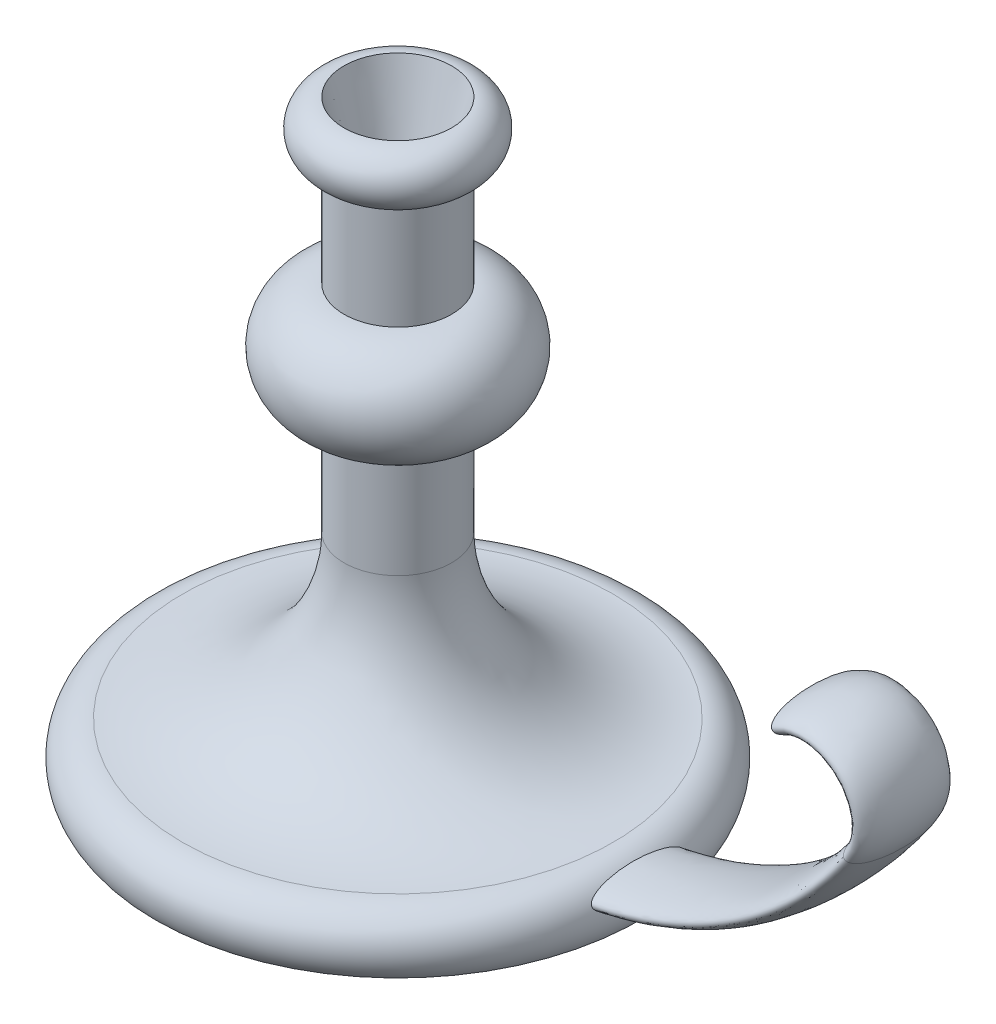
ISO-10303-21;
HEADER;
FILE_DESCRIPTION(('STEP AP214'),'2;1');
FILE_NAME('part.step','',(''),(''),'','','');
FILE_SCHEMA(('AUTOMOTIVE_DESIGN { 1 0 10303 214 1 1 1 1 }'));
ENDSEC;
DATA;
#1=APPLICATION_CONTEXT('core data for automotive mechanical design processes');
#2=APPLICATION_PROTOCOL_DEFINITION('international standard','automotive_design',2000,#1);
#3=PRODUCT_CONTEXT('',#1,'mechanical');
#4=PRODUCT('Part','Part','',(#3));
#5=PRODUCT_RELATED_PRODUCT_CATEGORY('part','',(#4));
#6=PRODUCT_DEFINITION_FORMATION('','',#4);
#7=PRODUCT_DEFINITION_CONTEXT('part definition',#1,'design');
#8=PRODUCT_DEFINITION('design','',#6,#7);
#9=PRODUCT_DEFINITION_SHAPE('','',#8);
#10=(LENGTH_UNIT() NAMED_UNIT(*) SI_UNIT(.MILLI.,.METRE.));
#11=(NAMED_UNIT(*) PLANE_ANGLE_UNIT() SI_UNIT($,.RADIAN.));
#12=(NAMED_UNIT(*) SI_UNIT($,.STERADIAN.) SOLID_ANGLE_UNIT());
#13=UNCERTAINTY_MEASURE_WITH_UNIT(LENGTH_MEASURE(1.E-05),#10,'distance_accuracy_value','');
#14=(GEOMETRIC_REPRESENTATION_CONTEXT(3) GLOBAL_UNCERTAINTY_ASSIGNED_CONTEXT((#13)) GLOBAL_UNIT_ASSIGNED_CONTEXT((#10,
#11,#12)) REPRESENTATION_CONTEXT('',''));
#15=CARTESIAN_POINT('',(0.,0.,0.));
#16=DIRECTION('',(0.,0.,1.));
#17=DIRECTION('',(1.,0.,0.));
#18=AXIS2_PLACEMENT_3D('',#15,#16,#17);
#19=CARTESIAN_POINT('',(0.,0.,0.));
#20=DIRECTION('',(0.,-1.,0.));
#21=DIRECTION('',(0.,0.,-1.));
#22=AXIS2_PLACEMENT_3D('',#19,#20,#21);
#23=PLANE('',#22);
#24=CARTESIAN_POINT('',(0.,0.,0.));
#25=DIRECTION('',(0.,-1.,0.));
#26=DIRECTION('',(0.,0.,-1.));
#27=AXIS2_PLACEMENT_3D('',#24,#25,#26);
#28=CIRCLE('',#27,90.);
#29=CARTESIAN_POINT('',(0.,0.,-90.));
#30=VERTEX_POINT('',#29);
#31=EDGE_CURVE('E77',#30,#30,#28,.T.);
#32=ORIENTED_EDGE('',*,*,#31,.T.);
#33=EDGE_LOOP('',(#32));
#34=FACE_BOUND('',#33,.T.);
#35=ADVANCED_FACE('F41',(#34),#23,.T.);
#36=CARTESIAN_POINT('',(0.,210.,0.));
#37=DIRECTION('',(0.,-1.,0.));
#38=DIRECTION('',(0.,0.,-1.));
#39=AXIS2_PLACEMENT_3D('',#36,#37,#38);
#40=TOROIDAL_SURFACE('',#39,20.,9.99999999999999);
#41=CARTESIAN_POINT('',(0.,220.,0.));
#42=DIRECTION('',(0.,1.,0.));
#43=DIRECTION('',(0.,0.,1.));
#44=AXIS2_PLACEMENT_3D('',#41,#42,#43);
#45=CIRCLE('',#44,20.);
#46=CARTESIAN_POINT('',(0.,220.,20.));
#47=VERTEX_POINT('',#46);
#48=EDGE_CURVE('E93',#47,#47,#45,.T.);
#49=ORIENTED_EDGE('',*,*,#48,.F.);
#50=EDGE_LOOP('',(#49));
#51=FACE_BOUND('',#50,.T.);
#52=CARTESIAN_POINT('',(0.,200.,0.));
#53=DIRECTION('',(0.,-1.,0.));
#54=DIRECTION('',(0.,0.,-1.));
#55=AXIS2_PLACEMENT_3D('',#52,#53,#54);
#56=CIRCLE('',#55,20.);
#57=CARTESIAN_POINT('',(0.,200.,-20.));
#58=VERTEX_POINT('',#57);
#59=EDGE_CURVE('E53',#58,#58,#56,.T.);
#60=ORIENTED_EDGE('',*,*,#59,.F.);
#61=EDGE_LOOP('',(#60));
#62=FACE_BOUND('',#61,.T.);
#63=ADVANCED_FACE('F100',(#51,#62),#40,.T.);
#64=CARTESIAN_POINT('',(0.,0.,0.));
#65=DIRECTION('',(0.,-1.,0.));
#66=DIRECTION('',(0.,0.,-1.));
#67=AXIS2_PLACEMENT_3D('',#64,#65,#66);
#68=CYLINDRICAL_SURFACE('',#67,20.);
#69=ORIENTED_EDGE('',*,*,#59,.T.);
#70=EDGE_LOOP('',(#69));
#71=FACE_BOUND('',#70,.T.);
#72=CARTESIAN_POINT('',(0.,160.,0.));
#73=DIRECTION('',(0.,-1.,0.));
#74=DIRECTION('',(0.,0.,-1.));
#75=AXIS2_PLACEMENT_3D('',#72,#73,#74);
#76=CIRCLE('',#75,20.);
#77=CARTESIAN_POINT('',(0.,160.,-20.));
#78=VERTEX_POINT('',#77);
#79=EDGE_CURVE('E58',#78,#78,#76,.T.);
#80=ORIENTED_EDGE('',*,*,#79,.F.);
#81=EDGE_LOOP('',(#80));
#82=FACE_BOUND('',#81,.T.);
#83=ADVANCED_FACE('F103',(#71,#82),#68,.T.);
#84=CARTESIAN_POINT('',(0.,140.,0.));
#85=DIRECTION('',(0.,-1.,0.));
#86=DIRECTION('',(0.,0.,-1.));
#87=AXIS2_PLACEMENT_3D('',#84,#85,#86);
#88=TOROIDAL_SURFACE('',#87,20.,20.);
#89=ORIENTED_EDGE('',*,*,#79,.T.);
#90=EDGE_LOOP('',(#89));
#91=FACE_BOUND('',#90,.T.);
#92=CARTESIAN_POINT('',(0.,120.,0.));
#93=DIRECTION('',(0.,-1.,0.));
#94=DIRECTION('',(0.,0.,-1.));
#95=AXIS2_PLACEMENT_3D('',#92,#93,#94);
#96=CIRCLE('',#95,20.);
#97=CARTESIAN_POINT('',(0.,120.,-20.));
#98=VERTEX_POINT('',#97);
#99=EDGE_CURVE('E63',#98,#98,#96,.T.);
#100=ORIENTED_EDGE('',*,*,#99,.F.);
#101=EDGE_LOOP('',(#100));
#102=FACE_BOUND('',#101,.T.);
#103=ADVANCED_FACE('F108',(#91,#102),#88,.T.);
#104=CARTESIAN_POINT('',(0.,0.,0.));
#105=DIRECTION('',(0.,-1.,0.));
#106=DIRECTION('',(0.,0.,-1.));
#107=AXIS2_PLACEMENT_3D('',#104,#105,#106);
#108=CYLINDRICAL_SURFACE('',#107,20.);
#109=ORIENTED_EDGE('',*,*,#99,.T.);
#110=EDGE_LOOP('',(#109));
#111=FACE_BOUND('',#110,.T.);
#112=CARTESIAN_POINT('',(0.,80.,0.));
#113=DIRECTION('',(0.,-1.,0.));
#114=DIRECTION('',(0.,0.,-1.));
#115=AXIS2_PLACEMENT_3D('',#112,#113,#114);
#116=CIRCLE('',#115,20.);
#117=CARTESIAN_POINT('',(0.,80.,-20.));
#118=VERTEX_POINT('',#117);
#119=EDGE_CURVE('E69',#118,#118,#116,.T.);
#120=ORIENTED_EDGE('',*,*,#119,.F.);
#121=EDGE_LOOP('',(#120));
#122=FACE_BOUND('',#121,.T.);
#123=ADVANCED_FACE('F114',(#111,#122),#108,.T.);
#124=CARTESIAN_POINT('',(0.,80.,0.));
#125=DIRECTION('',(0.,-1.,0.));
#126=DIRECTION('',(0.,0.,-1.));
#127=AXIS2_PLACEMENT_3D('',#124,#125,#126);
#128=TOROIDAL_SURFACE('',#127,80.,60.);
#129=ORIENTED_EDGE('',*,*,#119,.T.);
#130=EDGE_LOOP('',(#129));
#131=FACE_BOUND('',#130,.T.);
#132=CARTESIAN_POINT('',(0.,20.,0.));
#133=DIRECTION('',(0.,-1.,0.));
#134=DIRECTION('',(0.,0.,-1.));
#135=AXIS2_PLACEMENT_3D('',#132,#133,#134);
#136=CIRCLE('',#135,80.);
#137=CARTESIAN_POINT('',(0.,20.,-80.));
#138=VERTEX_POINT('',#137);
#139=EDGE_CURVE('E73',#138,#138,#136,.T.);
#140=ORIENTED_EDGE('',*,*,#139,.F.);
#141=EDGE_LOOP('',(#140));
#142=FACE_BOUND('',#141,.T.);
#143=ADVANCED_FACE('F118',(#131,#142),#128,.F.);
#144=CARTESIAN_POINT('',(0.,7.50000000000003,0.));
#145=DIRECTION('',(0.,-1.,0.));
#146=DIRECTION('',(0.,0.,-1.));
#147=AXIS2_PLACEMENT_3D('',#144,#145,#146);
#148=TOROIDAL_SURFACE('',#147,80.,12.5);
#149=CARTESIAN_POINT('',(89.5597422043342,12.9414346567555,-17.5));
#150=CARTESIAN_POINT('',(89.5390618403562,12.9834100865229,-17.4999996776707));
#151=CARTESIAN_POINT('',(89.518481763466,13.0254349004937,-17.4978446678338));
#152=CARTESIAN_POINT('',(89.4776811982744,13.1092324497794,-17.4892861575811));
#153=CARTESIAN_POINT('',(89.4574608430711,13.1510050881611,-17.4828811168849));
#154=CARTESIAN_POINT('',(89.397540281121,13.2754779151414,-17.4575154450276));
#155=CARTESIAN_POINT('',(89.3585808220613,13.357332519418,-17.4324042670614));
#156=CARTESIAN_POINT('',(89.2734407804368,13.5379179993389,-17.3597430943198));
#157=CARTESIAN_POINT('',(89.2281116968574,13.6353152430682,-17.3079906529225));
#158=CARTESIAN_POINT('',(89.142156713761,13.821757010941,-17.1881654215547));
#159=CARTESIAN_POINT('',(89.1015409681601,13.9107834263932,-17.1200583326704));
#160=CARTESIAN_POINT('',(89.0298799325306,14.0690063055582,-16.9825317839868));
#161=CARTESIAN_POINT('',(88.9982856031082,14.1392491335227,-16.9145677994464));
#162=CARTESIAN_POINT('',(88.9378435588022,14.2742914925202,-16.7722502997375));
#163=CARTESIAN_POINT('',(88.9089980734782,14.3390866000317,-16.6978916893925));
#164=CARTESIAN_POINT('',(88.8536099995594,14.4639626152392,-16.5442177801531));
#165=CARTESIAN_POINT('',(88.8270733532937,14.5240313225779,-16.4648905452803));
#166=CARTESIAN_POINT('',(88.7760376587064,14.6398576639347,-16.3025863942461));
#167=CARTESIAN_POINT('',(88.7515379613228,14.6956166708123,-16.219610653644));
#168=CARTESIAN_POINT('',(88.704732820549,14.8023169553036,-16.052427362784));
#169=CARTESIAN_POINT('',(88.6823939519366,14.8533308765833,-15.9682752160745));
#170=CARTESIAN_POINT('',(88.639155365759,14.9521540950118,-15.7977416210759));
#171=CARTESIAN_POINT('',(88.6182558899722,14.9999628537458,-15.711359801597));
#172=CARTESIAN_POINT('',(88.5573681790009,15.1392585624723,-15.4492483073625));
#173=CARTESIAN_POINT('',(88.5192579811328,15.2264609786255,-15.2707999543232));
#174=CARTESIAN_POINT('',(88.4468979005836,15.3916731276291,-14.9088289385944));
#175=CARTESIAN_POINT('',(88.4126513155027,15.4696750103546,-14.725302105289));
#176=CARTESIAN_POINT('',(88.347139159504,15.6182965032923,-14.3538259785736));
#177=CARTESIAN_POINT('',(88.3158872528146,15.6888824046966,-14.1658608782526));
#178=CARTESIAN_POINT('',(88.2560127035516,15.8233792512431,-13.7874003918539));
#179=CARTESIAN_POINT('',(88.2273872233003,15.8872974109117,-13.5969079973402));
#180=CARTESIAN_POINT('',(88.1723348827449,16.0094159388249,-13.213849673779));
#181=CARTESIAN_POINT('',(88.1459074726896,16.0676177374301,-13.021284276893));
#182=CARTESIAN_POINT('',(88.0884248304702,16.1932687928886,-12.5849658119247));
#183=CARTESIAN_POINT('',(88.0579162002184,16.2592725226906,-12.3407253521734));
#184=CARTESIAN_POINT('',(87.9994625659014,16.3844358500306,-11.8501803460781));
#185=CARTESIAN_POINT('',(87.9715178234089,16.4435947494062,-11.6038755919222));
#186=CARTESIAN_POINT('',(87.9178897421858,16.5558889779776,-11.1095299870479));
#187=CARTESIAN_POINT('',(87.8922075114269,16.6090213595568,-10.8614883492399));
#188=CARTESIAN_POINT('',(87.8429155378603,16.7098546386226,-10.3640943607017));
#189=CARTESIAN_POINT('',(87.8193058942812,16.7575552760879,-10.114741947821));
#190=CARTESIAN_POINT('',(87.7514718906047,16.8930622945828,-9.36631396644896));
#191=CARTESIAN_POINT('',(87.7101114199141,16.97354616682,-8.86564202060311));
#192=CARTESIAN_POINT('',(87.6344118706354,17.1178657179368,-7.86153551840225));
#193=CARTESIAN_POINT('',(87.600071334108,17.1817048544489,-7.35810155802561));
#194=CARTESIAN_POINT('',(87.5383679228555,17.2943697092708,-6.3522513611187));
#195=CARTESIAN_POINT('',(87.5109639050819,17.3432843238913,-5.84984753787553));
#196=CARTESIAN_POINT('',(87.4628391630612,17.4279603163538,-4.84354228831007));
#197=CARTESIAN_POINT('',(87.4421195253373,17.4637195559667,-4.33964063194087));
#198=CARTESIAN_POINT('',(87.4074386787955,17.5229738360405,-3.3308436388601));
#199=CARTESIAN_POINT('',(87.3934780874882,17.5464677559496,-2.82594821558678));
#200=CARTESIAN_POINT('',(87.3724154174236,17.5817273168609,-1.816152133808));
#201=CARTESIAN_POINT('',(87.365305974734,17.5935055508652,-1.31125206554517));
#202=CARTESIAN_POINT('',(87.3579750479625,17.6056484066489,-0.301318309132875));
#203=CARTESIAN_POINT('',(87.3577528582351,17.6060141977103,0.203715360026125));
#204=CARTESIAN_POINT('',(87.3641963426439,17.5953454261039,1.21356726554173));
#205=CARTESIAN_POINT('',(87.3708612610896,17.5843121142069,1.71838551945512));
#206=CARTESIAN_POINT('',(87.3886163883338,17.554616306541,2.60695068649856));
#207=CARTESIAN_POINT('',(87.3982690399213,17.5384060734754,2.99081046478843));
#208=CARTESIAN_POINT('',(87.421496688066,17.4990063104014,3.75807002785716));
#209=CARTESIAN_POINT('',(87.4350718235981,17.4758165331044,4.14146979585432));
#210=CARTESIAN_POINT('',(87.4661109016122,17.4221255760208,4.90767543763213));
#211=CARTESIAN_POINT('',(87.483575591365,17.3916229911934,5.29048118303763));
#212=CARTESIAN_POINT('',(87.52247652696,17.3226675403927,6.05728766608041));
#213=CARTESIAN_POINT('',(87.5439339089184,17.2841722314846,6.44128353835446));
#214=CARTESIAN_POINT('',(87.5907685418078,17.1987228636429,7.20803081067562));
#215=CARTESIAN_POINT('',(87.6161451191906,17.1517702579396,7.59078241304236));
#216=CARTESIAN_POINT('',(87.6708875244929,17.0486132676472,8.35453102594121));
#217=CARTESIAN_POINT('',(87.7002509792864,16.9924143825779,8.73552894189142));
#218=CARTESIAN_POINT('',(87.7555693385742,16.8844873931684,9.40362807317352));
#219=CARTESIAN_POINT('',(87.7806318626291,16.8349635590469,9.69115955865569));
#220=CARTESIAN_POINT('',(87.8333287645208,16.7293167465828,10.2648242071223));
#221=CARTESIAN_POINT('',(87.8609635304672,16.6731927720484,10.5509571522123));
#222=CARTESIAN_POINT('',(87.9190678138249,16.5534902310351,11.1217112831613));
#223=CARTESIAN_POINT('',(87.9495404231884,16.4899035134826,11.4063304543325));
#224=CARTESIAN_POINT('',(88.0137266324376,16.3541216812726,11.9738772339477));
#225=CARTESIAN_POINT('',(88.0474477220508,16.2819065762201,12.2567992545899));
#226=CARTESIAN_POINT('',(88.1183718381954,16.1280994435203,12.8175821097589));
#227=CARTESIAN_POINT('',(88.1555499028384,16.046573796357,13.0954641920683));
#228=CARTESIAN_POINT('',(88.2343580118385,15.8719007074313,13.6468218234688));
#229=CARTESIAN_POINT('',(88.2759857295859,15.7787593350285,13.9202995902183));
#230=CARTESIAN_POINT('',(88.342656822394,15.6283840406489,14.3254052817093));
#231=CARTESIAN_POINT('',(88.3655500017785,15.5765627213432,14.4594023169281));
#232=CARTESIAN_POINT('',(88.4129882653633,15.4688611687534,14.7254525655376));
#233=CARTESIAN_POINT('',(88.4375331689951,15.4129813790935,14.8575059894888));
#234=CARTESIAN_POINT('',(88.4884967907573,15.296726972035,15.1188747284345));
#235=CARTESIAN_POINT('',(88.5149109123159,15.2363633637365,15.248195809858));
#236=CARTESIAN_POINT('',(88.5700241751772,15.1103179001211,15.5037035642082));
#237=CARTESIAN_POINT('',(88.5987227483178,15.0446373670988,15.6298910063174));
#238=CARTESIAN_POINT('',(88.6570151826479,14.9113179601608,15.870419970706));
#239=CARTESIAN_POINT('',(88.6864417367861,14.8440563407289,15.9850095995261));
#240=CARTESIAN_POINT('',(88.7482816567768,14.7030103830826,16.2094581395953));
#241=CARTESIAN_POINT('',(88.7806974756141,14.629220689998,16.3193130551169));
#242=CARTESIAN_POINT('',(88.8489097184973,14.4745639616531,16.5315146626624));
#243=CARTESIAN_POINT('',(88.8846785573509,14.3937550191611,16.6339121024917));
#244=CARTESIAN_POINT('',(88.9606113704153,14.2232561160766,16.8291907541923));
#245=CARTESIAN_POINT('',(89.0007675950253,14.1335818404864,16.9220882016583));
#246=CARTESIAN_POINT('',(89.0601235459873,14.0021924630804,17.0411637727685));
#247=CARTESIAN_POINT('',(89.0770574086405,13.9648250339927,17.073294917827));
#248=CARTESIAN_POINT('',(89.1117704043089,13.8885105828123,17.1351129203988));
#249=CARTESIAN_POINT('',(89.1295494801999,13.8495636674961,17.1647999427302));
#250=CARTESIAN_POINT('',(89.1842722230347,13.7301865324197,17.2496672583031));
#251=CARTESIAN_POINT('',(89.2225929343976,13.6472387371286,17.3006362954167));
#252=CARTESIAN_POINT('',(89.2830198855204,13.5177923286576,17.3659392171785));
#253=CARTESIAN_POINT('',(89.3038035106326,13.4734899832391,17.385944655127));
#254=CARTESIAN_POINT('',(89.3462357272131,13.3835498526412,17.421521231844));
#255=CARTESIAN_POINT('',(89.3678838017236,13.3379128698458,17.4370949768747));
#256=CARTESIAN_POINT('',(89.411904802424,13.2456714845448,17.4633118273199));
#257=CARTESIAN_POINT('',(89.4342765183816,13.1990687398024,17.4739627514632));
#258=CARTESIAN_POINT('',(89.4796070415907,13.1052444737537,17.4900003628641));
#259=CARTESIAN_POINT('',(89.5025657624809,13.0580230439622,17.495387819971));
#260=CARTESIAN_POINT('',(89.5464271716019,12.9684112208445,17.5004320668286));
#261=CARTESIAN_POINT('',(89.5672934245652,12.9260327119426,17.5006298436875));
#262=CARTESIAN_POINT('',(89.6091580078857,12.8415284156483,17.496667300483));
#263=CARTESIAN_POINT('',(89.6301563797469,12.7994027167221,17.4925055351934));
#264=CARTESIAN_POINT('',(89.6721156351431,12.7157496198108,17.479965082583));
#265=CARTESIAN_POINT('',(89.6930765014329,12.6742224548788,17.4715847960013));
#266=CARTESIAN_POINT('',(89.7348115258834,12.5920532516238,17.450862522026));
#267=CARTESIAN_POINT('',(89.7555855765781,12.5514117057388,17.4385183877269));
#268=CARTESIAN_POINT('',(89.8013847331777,12.4623676182577,17.4070626989759));
#269=CARTESIAN_POINT('',(89.8263321178974,12.4142402057078,17.3870577635768));
#270=CARTESIAN_POINT('',(89.8756026524763,12.3198942829529,17.3423007335127));
#271=CARTESIAN_POINT('',(89.8999253272692,12.2736772101063,17.317545140678));
#272=CARTESIAN_POINT('',(89.9718636752115,12.1379719567038,17.2371059859824));
#273=CARTESIAN_POINT('',(90.0184026508769,12.0515209207989,17.1752845379973));
#274=CARTESIAN_POINT('',(90.1015176697338,11.8991704299986,17.0502729237444));
#275=CARTESIAN_POINT('',(90.1385373685485,11.832138329749,16.9886971231213));
#276=CARTESIAN_POINT('',(90.210486932928,11.7032426034951,16.8591573255862));
#277=CARTESIAN_POINT('',(90.24541514088,11.6413830620089,16.7911883686367));
#278=CARTESIAN_POINT('',(90.3133841124366,11.5222099067342,16.6502911436157));
#279=CARTESIAN_POINT('',(90.3464212107125,11.4649050425,16.577353807455));
#280=CARTESIAN_POINT('',(90.4107258034175,11.3544143267812,16.4277349965839));
#281=CARTESIAN_POINT('',(90.4419937497579,11.3012274221162,16.3510544874357));
#282=CARTESIAN_POINT('',(90.5066142435688,11.1922810586096,16.1853189525369));
#283=CARTESIAN_POINT('',(90.5397652495639,11.1369814833086,16.095884783533));
#284=CARTESIAN_POINT('',(90.6043042941242,11.0303194621557,15.9140859303205));
#285=CARTESIAN_POINT('',(90.6356921559876,10.9789574107339,15.8217209538335));
#286=CARTESIAN_POINT('',(90.6968383877971,10.879769884165,15.6347974994412));
#287=CARTESIAN_POINT('',(90.7265992701637,10.8319389137697,15.5402427441419));
#288=CARTESIAN_POINT('',(90.7846969346252,10.739329513768,15.3492353522604));
#289=CARTESIAN_POINT('',(90.8130337948205,10.6945509167066,15.2527828201662));
#290=CARTESIAN_POINT('',(90.877121220524,10.5940589597548,15.0277319837681));
#291=CARTESIAN_POINT('',(90.9124022819658,10.5393328792865,14.898559344014));
#292=CARTESIAN_POINT('',(90.9809741103802,10.4339610325183,14.6380328432607));
#293=CARTESIAN_POINT('',(91.0142645951403,10.3833158444317,14.5066786763345));
#294=CARTESIAN_POINT('',(91.1115171918214,10.2366440116076,14.1096810918778));
#295=CARTESIAN_POINT('',(91.1727828792967,10.1460018602113,13.8413800425916));
#296=CARTESIAN_POINT('',(91.2892862812461,9.97615455726906,13.2997906638456));
#297=CARTESIAN_POINT('',(91.3445203789088,9.89695625887029,13.0264994554533));
#298=CARTESIAN_POINT('',(91.4499805719981,9.74769654866257,12.4748594155945));
#299=CARTESIAN_POINT('',(91.5001780442573,9.6776867307801,12.1964912536694));
#300=CARTESIAN_POINT('',(91.5957501918068,9.54592534416379,11.637239342574));
#301=CARTESIAN_POINT('',(91.6411285723794,9.48416742117622,11.3563577087901));
#302=CARTESIAN_POINT('',(91.7275132616965,9.3677978716254,10.7925089006671));
#303=CARTESIAN_POINT('',(91.7685202729421,9.31318509647916,10.5095420692677));
#304=CARTESIAN_POINT('',(91.8503345045437,9.20520508711799,9.91387150213544));
#305=CARTESIAN_POINT('',(91.8907217744489,9.15249390095805,9.60099168323523));
#306=CARTESIAN_POINT('',(91.966921819911,9.05389158705526,8.97359688181856));
#307=CARTESIAN_POINT('',(92.0027343661631,9.00800080116132,8.65908181815829));
#308=CARTESIAN_POINT('',(92.0700329889401,8.92240020575301,8.02865568808661));
#309=CARTESIAN_POINT('',(92.101517751625,8.8826922727619,7.71274422766375));
#310=CARTESIAN_POINT('',(92.1603325838503,8.808987136793,7.0798662681049));
#311=CARTESIAN_POINT('',(92.187662500542,8.77499014390495,6.76289973059277));
#312=CARTESIAN_POINT('',(92.2635030013651,8.68114273902093,5.8124986836211));
#313=CARTESIAN_POINT('',(92.3060517448553,8.62919999492186,5.17778747193732));
#314=CARTESIAN_POINT('',(92.3760091017525,8.54431318450685,3.90627938186707));
#315=CARTESIAN_POINT('',(92.4034169750229,8.51137004695184,3.26948240305168));
#316=CARTESIAN_POINT('',(92.4435085691828,8.46331702284117,1.99545741778321));
#317=CARTESIAN_POINT('',(92.4562084043365,8.44818761908846,1.35823064985294));
#318=CARTESIAN_POINT('',(92.4671302630246,8.43517103988552,0.0834423270802422));
#319=CARTESIAN_POINT('',(92.4653514271759,8.43728488791032,-0.554119245388642));
#320=CARTESIAN_POINT('',(92.4472853754492,8.45883344750923,-1.82886328297048));
#321=CARTESIAN_POINT('',(92.4309954438924,8.4782714012033,-2.46604565478163));
#322=CARTESIAN_POINT('',(92.3836590626409,8.53514174464798,-3.73902583867075));
#323=CARTESIAN_POINT('',(92.3526140808133,8.57257234445225,-4.37482378215576));
#324=CARTESIAN_POINT('',(92.2921790866403,8.64621329195001,-5.3662554446105));
#325=CARTESIAN_POINT('',(92.2680118235608,8.67578736963485,-5.72271555901935));
#326=CARTESIAN_POINT('',(92.2147013952354,8.74146404735396,-6.4346581960336));
#327=CARTESIAN_POINT('',(92.1855583836333,8.77756644580544,-6.79014074848038));
#328=CARTESIAN_POINT('',(92.1221127048893,8.85679311513356,-7.49983836059533));
#329=CARTESIAN_POINT('',(92.0878103957548,8.89991689880828,-7.85405350646513));
#330=CARTESIAN_POINT('',(92.013798122625,8.99384143269655,-8.56089767223961));
#331=CARTESIAN_POINT('',(91.9740883343958,9.04464193338986,-8.91352674331382));
#332=CARTESIAN_POINT('',(91.9015818240063,9.13842562293723,-9.51226790233151));
#333=CARTESIAN_POINT('',(91.8702370654071,9.17924629619441,-9.75889575934236));
#334=CARTESIAN_POINT('',(91.8045624920057,9.26550036635918,-10.2509419620306));
#335=CARTESIAN_POINT('',(91.770232756707,9.31093364041775,-10.4963603397379));
#336=CARTESIAN_POINT('',(91.6984266463271,9.40685898724887,-10.9855805665739));
#337=CARTESIAN_POINT('',(91.6609523533816,9.45734771681971,-11.229383371817));
#338=CARTESIAN_POINT('',(91.5826038967891,9.56401317099031,-11.715177562105));
#339=CARTESIAN_POINT('',(91.5417298772536,9.6201896545132,-11.9571690234578));
#340=CARTESIAN_POINT('',(91.4386423376746,9.76351210996389,-12.5384162018487));
#341=CARTESIAN_POINT('',(91.3745858903288,9.85386844470752,-12.8765786557774));
#342=CARTESIAN_POINT('',(91.2720163238266,10.0014015523807,-13.3793136041314));
#343=CARTESIAN_POINT('',(91.2367090969992,10.0526332971694,-13.5462966135009));
#344=CARTESIAN_POINT('',(91.1637294936457,10.1596261841619,-13.8782853379557));
#345=CARTESIAN_POINT('',(91.1260572231721,10.215387123302,-14.0432911413076));
#346=CARTESIAN_POINT('',(91.0448513753997,10.3369382727869,-14.384441669313));
#347=CARTESIAN_POINT('',(91.0010908407915,10.4031767890599,-14.5603739146116));
#348=CARTESIAN_POINT('',(90.9100440331645,10.5428509324199,-14.9085311659833));
#349=CARTESIAN_POINT('',(90.8627565865345,10.6162889577864,-15.0807549132315));
#350=CARTESIAN_POINT('',(90.7642492199854,10.7715651970482,-15.4195496037305));
#351=CARTESIAN_POINT('',(90.7130423069866,10.8533759065569,-15.5861368065586));
#352=CARTESIAN_POINT('',(90.6058220172113,11.0275348916431,-15.9120386126951));
#353=CARTESIAN_POINT('',(90.5498128203451,11.1198740259082,-16.0713593593325));
#354=CARTESIAN_POINT('',(90.444408289305,11.2969255920342,-16.3465910082042));
#355=CARTESIAN_POINT('',(90.3961277047704,11.3791055101426,-16.4645448336191));
#356=CARTESIAN_POINT('',(90.2950977924847,11.5538633486868,-16.6911566146552));
#357=CARTESIAN_POINT('',(90.2423390562531,11.6464633011955,-16.7997939840168));
#358=CARTESIAN_POINT('',(90.1590440243456,11.7953014200274,-16.9524870890687));
#359=CARTESIAN_POINT('',(90.1303607600847,11.8469859215398,-17.0019977189782));
#360=CARTESIAN_POINT('',(90.0716181087374,11.9538274561511,-17.09631026111));
#361=CARTESIAN_POINT('',(90.0415584049394,12.0089852895525,-17.141111081734));
#362=CARTESIAN_POINT('',(89.9801756575596,12.1227246632091,-17.2246441347399));
#363=CARTESIAN_POINT('',(89.948857753765,12.181292641625,-17.2633984155373));
#364=CARTESIAN_POINT('',(89.8849549671328,12.3020144005063,-17.3335784406432));
#365=CARTESIAN_POINT('',(89.8523712452273,12.3641649194656,-17.3650107233705));
#366=CARTESIAN_POINT('',(89.7981176909034,12.4687258013537,-17.4092508881815));
#367=CARTESIAN_POINT('',(89.7767436177655,12.5101841078547,-17.4246893204628));
#368=CARTESIAN_POINT('',(89.7336969050674,12.5942336377179,-17.4515182330193));
#369=CARTESIAN_POINT('',(89.7120243813912,12.636824427018,-17.4629102408533));
#370=CARTESIAN_POINT('',(89.6685521390583,12.7228207531292,-17.4812886417918));
#371=CARTESIAN_POINT('',(89.6467526103346,12.766225219827,-17.488280453409));
#372=CARTESIAN_POINT('',(89.6031794397246,12.8535466229688,-17.4976362320133));
#373=CARTESIAN_POINT('',(89.5814057970823,12.8974635440192,-17.5000003376542));
#374=CARTESIAN_POINT('',(89.5597422043342,12.9414346567555,-17.5));
#375=B_SPLINE_CURVE_WITH_KNOTS('',3,(#149,#150,#151,#152,#153,#154,#155,#156,#157,#158,#159,
#160,#161,#162,#163,#164,#165,#166,#167,#168,#169,#170,#171,#172,#173,#174,#175,#176,#177,#178,
#179,#180,#181,#182,#183,#184,#185,#186,#187,#188,#189,#190,#191,#192,#193,#194,#195,#196,#197,
#198,#199,#200,#201,#202,#203,#204,#205,#206,#207,#208,#209,#210,#211,#212,#213,#214,#215,#216,
#217,#218,#219,#220,#221,#222,#223,#224,#225,#226,#227,#228,#229,#230,#231,#232,#233,#234,#235,
#236,#237,#238,#239,#240,#241,#242,#243,#244,#245,#246,#247,#248,#249,#250,#251,#252,#253,#254,
#255,#256,#257,#258,#259,#260,#261,#262,#263,#264,#265,#266,#267,#268,#269,#270,#271,#272,#273,
#274,#275,#276,#277,#278,#279,#280,#281,#282,#283,#284,#285,#286,#287,#288,#289,#290,#291,#292,
#293,#294,#295,#296,#297,#298,#299,#300,#301,#302,#303,#304,#305,#306,#307,#308,#309,#310,#311,
#312,#313,#314,#315,#316,#317,#318,#319,#320,#321,#322,#323,#324,#325,#326,#327,#328,#329,#330,
#331,#332,#333,#334,#335,#336,#337,#338,#339,#340,#341,#342,#343,#344,#345,#346,#347,#348,#349,
#350,#351,#352,#353,#354,#355,#356,#357,#358,#359,#360,#361,#362,#363,#364,#365,#366,#367,#368,
#369,#370,#371,#372,#373,#374),.UNSPECIFIED.,.T.,.F.,(4,2,2,2,2,2,2,2,2,2,2,2,2,2,2,2,2,2,2,2,2,
2,2,2,2,2,2,2,2,2,2,2,2,2,2,2,2,2,2,2,2,2,2,2,2,2,2,2,2,2,2,2,2,2,2,2,2,2,2,2,2,2,2,2,2,2,2,2,2,
2,2,2,2,2,2,2,2,2,2,2,2,2,2,2,2,2,2,2,2,2,2,2,2,2,2,2,2,2,2,2,2,2,2,2,2,2,2,2,2,2,2,2,4),(0.,
0.140326879649318,0.280704643844319,0.561461806499968,0.917225717585827,1.27374235386085,
1.58146302398147,1.88943119593641,2.19816989275476,2.50680983170026,2.8094429237275,
3.11212672643257,3.71838915770194,4.32516518168248,4.93458970782545,5.54334784093539,
6.1519532590665,6.91631911029047,7.68076285707089,8.44557890144727,9.21043154271132,
10.7363530227228,12.2619572680851,13.7782885580524,15.2948661984783,16.8115823682402,
18.3266664767785,19.8415953542036,21.3563580231469,22.5092504482308,23.6621837256809,
24.8153386988898,25.9747813799631,27.1340250219355,28.2925816429425,29.1710242088839,
30.0495995331115,30.9291435591543,31.8107663507035,32.6864555684208,33.5616891298976,
33.9980703124478,34.4344038665404,34.8696994156047,35.3048870393031,35.7129485465614,
36.1213479397354,36.5266413619585,36.931230132163,37.0874810726011,37.2437214677038,
37.556282943945,37.7147148343192,37.8730533580127,38.0311395270883,38.1892025705742,
38.3307149014329,38.4722741597123,38.6138871242242,38.7555769191151,38.9286541005773,
39.1018592207182,39.448590135234,39.7429975955387,40.0376353818192,40.3328261359408,
40.6279411430423,40.9585479808936,41.2891878931731,41.6193018978018,41.9493977775692,
42.3832551508602,42.8171738887972,43.6859467918771,44.5552378220705,45.4292182663367,
46.3025217875284,47.1756847521817,48.1351081860338,49.0945796914528,50.0543418354868,
51.014139278794,52.9283366636019,54.8426276125093,56.7548192562821,58.6671243992173,
60.5797874956874,62.4922603557708,63.5676819321858,64.6430703071883,65.7183840946035,
66.7936629380631,67.5494303160609,68.3051775707196,69.0604283053782,69.8156470419357,
70.8826765887355,71.4172057561802,71.9517109715331,72.5305894861729,73.1096614946436,
73.6868888443996,74.2636187787014,74.7180950553378,75.1735510009091,75.4046853668803,
75.6358731855897,75.8661972266867,76.0963147970919,76.2435550398536,76.3907396389803,
76.5377426347989,76.6847412260987),.UNSPECIFIED.);
#376=CARTESIAN_POINT('',(89.5597422043342,12.9414346567555,-17.5));
#377=VERTEX_POINT('',#376);
#378=EDGE_CURVE('E10',#377,#377,#375,.T.);
#379=ORIENTED_EDGE('',*,*,#378,.F.);
#380=EDGE_LOOP('',(#379));
#381=FACE_BOUND('',#380,.T.);
#382=ORIENTED_EDGE('',*,*,#139,.T.);
#383=EDGE_LOOP('',(#382));
#384=FACE_BOUND('',#383,.T.);
#385=ORIENTED_EDGE('',*,*,#31,.F.);
#386=EDGE_LOOP('',(#385));
#387=FACE_BOUND('',#386,.T.);
#388=ADVANCED_FACE('F121',(#381,#384,#387),#148,.T.);
#389=CARTESIAN_POINT('',(156.580798093131,103.335392725037,0.));
#390=DIRECTION('',(-0.850102969585197,-0.526616502877026,0.));
#391=DIRECTION('',(0.,0.,-1.));
#392=AXIS2_PLACEMENT_3D('',#389,#390,#391);
#393=PLANE('',#392);
#394=CARTESIAN_POINT('',(156.580798093131,103.335392725037,0.));
#395=DIRECTION('',(-0.850102969585197,-0.526616502877026,0.));
#396=DIRECTION('',(0.,0.,-1.));
#397=AXIS2_PLACEMENT_3D('',#394,#395,#396);
#398=ELLIPSE('',#397,17.5,5.);
#399=CARTESIAN_POINT('',(156.580798093131,103.335392725037,-17.5));
#400=VERTEX_POINT('',#399);
#401=EDGE_CURVE('E81',#400,#400,#398,.T.);
#402=ORIENTED_EDGE('',*,*,#401,.T.);
#403=EDGE_LOOP('',(#402));
#404=FACE_BOUND('',#403,.T.);
#405=ADVANCED_FACE('F126',(#404),#393,.T.);
#406=CARTESIAN_POINT('',(60.,10.,-17.5));
#407=CARTESIAN_POINT('',(110.410191303973,10.,-17.5));
#408=CARTESIAN_POINT('',(155.026295870831,33.4646670673665,-17.5));
#409=CARTESIAN_POINT('',(183.592070943083,75.,-17.5));
#410=CARTESIAN_POINT('',(60.,20.,-17.5));
#411=CARTESIAN_POINT('',(107.049511883708,20.,-17.5));
#412=CARTESIAN_POINT('',(148.691209479443,41.9003559295421,-17.5));
#413=CARTESIAN_POINT('',(175.352599546877,80.6666666666666,-17.5));
#414=CARTESIAN_POINT('',(60.,20.,17.5));
#415=CARTESIAN_POINT('',(107.049511883708,20.,17.5));
#416=CARTESIAN_POINT('',(148.691209479443,41.9003559295421,17.5));
#417=CARTESIAN_POINT('',(175.352599546877,80.6666666666666,17.5));
#418=CARTESIAN_POINT('',(60.,10.,17.5));
#419=CARTESIAN_POINT('',(110.410191303973,10.,17.5));
#420=CARTESIAN_POINT('',(155.026295870831,33.4646670673665,17.5));
#421=CARTESIAN_POINT('',(183.592070943083,75.,17.5));
#422=CARTESIAN_POINT('',(60.,0.,17.5));
#423=CARTESIAN_POINT('',(113.770870724238,0.,17.5));
#424=CARTESIAN_POINT('',(161.36138226222,25.0289782051909,17.5));
#425=CARTESIAN_POINT('',(191.831542339288,69.3333333333333,17.5));
#426=CARTESIAN_POINT('',(60.,0.,-17.5));
#427=CARTESIAN_POINT('',(113.770870724238,0.,-17.5));
#428=CARTESIAN_POINT('',(161.36138226222,25.0289782051909,-17.5));
#429=CARTESIAN_POINT('',(191.831542339288,69.3333333333333,-17.5));
#430=CARTESIAN_POINT('',(60.,10.,-17.5));
#431=CARTESIAN_POINT('',(110.410191303973,10.,-17.5));
#432=CARTESIAN_POINT('',(155.026295870831,33.4646670673665,-17.5));
#433=CARTESIAN_POINT('',(183.592070943083,75.,-17.5));
#434=(BOUNDED_SURFACE() B_SPLINE_SURFACE(3,3,((#406,#407,#408,#409),(#410,#411,#412,#413),(#414,
#415,#416,#417),(#418,#419,#420,#421),(#422,#423,#424,#425),(#426,#427,#428,#429),(#430,#431,
#432,#433)),.UNSPECIFIED.,.T.,.F.,.F.) B_SPLINE_SURFACE_WITH_KNOTS((4,3,4),(4,4),(0.,0.5,1.),
(0.,1.),.UNSPECIFIED.) GEOMETRIC_REPRESENTATION_ITEM() RATIONAL_B_SPLINE_SURFACE(((1.,
0.923374135437856,0.923374135437856,1.),(0.333333333333333,0.307791378479285,0.307791378479285,
0.333333333333333),(0.333333333333333,0.307791378479285,0.307791378479285,0.333333333333333),
(1.,0.923374135437856,0.923374135437856,1.),(0.333333333333333,0.307791378479285,
0.307791378479285,0.333333333333333),(0.333333333333333,0.307791378479285,0.307791378479285,
0.333333333333333),(1.,0.923374135437856,0.923374135437856,1.))) REPRESENTATION_ITEM('') SURFACE());
#435=CARTESIAN_POINT('',(183.592070943083,75.,0.));
#436=DIRECTION('',(0.566666666666667,0.823947139620552,0.));
#437=DIRECTION('',(0.,0.,-1.));
#438=AXIS2_PLACEMENT_3D('',#435,#436,#437);
#439=ELLIPSE('',#438,17.5,5.);
#440=CARTESIAN_POINT('',(183.592070943083,75.,-17.5));
#441=VERTEX_POINT('',#440);
#442=EDGE_CURVE('E85',#441,#441,#439,.T.);
#443=ORIENTED_EDGE('',*,*,#378,.T.);
#444=EDGE_LOOP('',(#443));
#445=FACE_BOUND('',#444,.T.);
#446=ORIENTED_EDGE('',*,*,#442,.F.);
#447=EDGE_LOOP('',(#446));
#448=FACE_BOUND('',#447,.T.);
#449=ADVANCED_FACE('F131',(#445,#448),#434,.T.);
#450=CARTESIAN_POINT('',(183.592070943083,75.,-17.5));
#451=CARTESIAN_POINT('',(199.316270581946,97.8633693798775,-17.5));
#452=CARTESIAN_POINT('',(180.169954811981,117.94825688567,-17.5));
#453=CARTESIAN_POINT('',(156.580798093131,103.335392725037,-17.5));
#454=CARTESIAN_POINT('',(175.352599546877,80.6666666666667,-17.5));
#455=CARTESIAN_POINT('',(183.214699366309,92.0983513566054,-17.5));
#456=CARTESIAN_POINT('',(173.641541481326,102.140795109502,-17.5));
#457=CARTESIAN_POINT('',(161.846963121901,94.8343630291853,-17.5));
#458=CARTESIAN_POINT('',(175.352599546877,80.6666666666667,17.5));
#459=CARTESIAN_POINT('',(183.214699366309,92.0983513566054,17.5));
#460=CARTESIAN_POINT('',(173.641541481326,102.140795109502,17.5));
#461=CARTESIAN_POINT('',(161.846963121901,94.8343630291853,17.5));
#462=CARTESIAN_POINT('',(183.592070943083,75.,17.5));
#463=CARTESIAN_POINT('',(199.316270581946,97.8633693798775,17.5));
#464=CARTESIAN_POINT('',(180.169954811981,117.94825688567,17.5));
#465=CARTESIAN_POINT('',(156.580798093131,103.335392725037,17.5));
#466=CARTESIAN_POINT('',(191.831542339288,69.3333333333333,17.5));
#467=CARTESIAN_POINT('',(215.417841797583,103.62838740315,17.5));
#468=CARTESIAN_POINT('',(186.698368142635,133.755718661838,17.5));
#469=CARTESIAN_POINT('',(151.314633064361,111.836422420889,17.5));
#470=CARTESIAN_POINT('',(191.831542339288,69.3333333333333,-17.5));
#471=CARTESIAN_POINT('',(215.417841797583,103.62838740315,-17.5));
#472=CARTESIAN_POINT('',(186.698368142635,133.755718661838,-17.5));
#473=CARTESIAN_POINT('',(151.314633064361,111.836422420889,-17.5));
#474=CARTESIAN_POINT('',(183.592070943083,75.,-17.5));
#475=CARTESIAN_POINT('',(199.316270581946,97.8633693798775,-17.5));
#476=CARTESIAN_POINT('',(180.169954811981,117.94825688567,-17.5));
#477=CARTESIAN_POINT('',(156.580798093131,103.335392725037,-17.5));
#478=(BOUNDED_SURFACE() B_SPLINE_SURFACE(3,3,((#450,#451,#452,#453),(#454,#455,#456,#457),(#458,
#459,#460,#461),(#462,#463,#464,#465),(#466,#467,#468,#469),(#470,#471,#472,#473),(#474,#475,
#476,#477)),.UNSPECIFIED.,.T.,.F.,.F.) B_SPLINE_SURFACE_WITH_KNOTS((4,3,4),(4,4),(0.,0.5,1.),
(0.,1.),.UNSPECIFIED.) GEOMETRIC_REPRESENTATION_ITEM() RATIONAL_B_SPLINE_SURFACE(((1.,
0.470260583019043,0.470260583019043,1.),(0.333333333333333,0.156753527673014,0.156753527673014,
0.333333333333333),(0.333333333333333,0.156753527673014,0.156753527673014,0.333333333333333),
(1.,0.470260583019043,0.470260583019043,1.),(0.333333333333333,0.156753527673014,
0.156753527673014,0.333333333333333),(0.333333333333333,0.156753527673014,0.156753527673014,
0.333333333333333),(1.,0.470260583019043,0.470260583019043,1.))) REPRESENTATION_ITEM('') SURFACE());
#479=ORIENTED_EDGE('',*,*,#401,.F.);
#480=EDGE_LOOP('',(#479));
#481=FACE_BOUND('',#480,.T.);
#482=ORIENTED_EDGE('',*,*,#442,.T.);
#483=EDGE_LOOP('',(#482));
#484=FACE_BOUND('',#483,.T.);
#485=ADVANCED_FACE('F128',(#481,#484),#478,.T.);
#486=CARTESIAN_POINT('',(0.,220.,0.));
#487=DIRECTION('',(0.,1.,0.));
#488=DIRECTION('',(0.,0.,1.));
#489=AXIS2_PLACEMENT_3D('',#486,#487,#488);
#490=CONICAL_SURFACE('',#489,20.,0.26179938779915);
#491=CARTESIAN_POINT('',(0.,195.,0.));
#492=DIRECTION('',(0.,1.,0.));
#493=DIRECTION('',(0.,0.,1.));
#494=AXIS2_PLACEMENT_3D('',#491,#492,#493);
#495=CIRCLE('',#494,13.3012701892219);
#496=CARTESIAN_POINT('',(0.,195.,13.3012701892219));
#497=VERTEX_POINT('',#496);
#498=EDGE_CURVE('E89',#497,#497,#495,.T.);
#499=ORIENTED_EDGE('',*,*,#498,.F.);
#500=EDGE_LOOP('',(#499));
#501=FACE_BOUND('',#500,.T.);
#502=ORIENTED_EDGE('',*,*,#48,.T.);
#503=EDGE_LOOP('',(#502));
#504=FACE_BOUND('',#503,.T.);
#505=ADVANCED_FACE('F98',(#501,#504),#490,.F.);
#506=CARTESIAN_POINT('',(0.,195.,0.));
#507=DIRECTION('',(0.,1.,0.));
#508=DIRECTION('',(0.,0.,1.));
#509=AXIS2_PLACEMENT_3D('',#506,#507,#508);
#510=PLANE('',#509);
#511=ORIENTED_EDGE('',*,*,#498,.T.);
#512=EDGE_LOOP('',(#511));
#513=FACE_BOUND('',#512,.T.);
#514=ADVANCED_FACE('F154',(#513),#510,.T.);
#515=CLOSED_SHELL('',(#35,#63,#83,#103,#123,#143,#388,#405,#449,#485,#505,#514));
#516=MANIFOLD_SOLID_BREP('B2',#515);
#517=ADVANCED_BREP_SHAPE_REPRESENTATION('',(#18,#516),#14);
#518=SHAPE_DEFINITION_REPRESENTATION(#9,#517);
ENDSEC;
END-ISO-10303-21;
